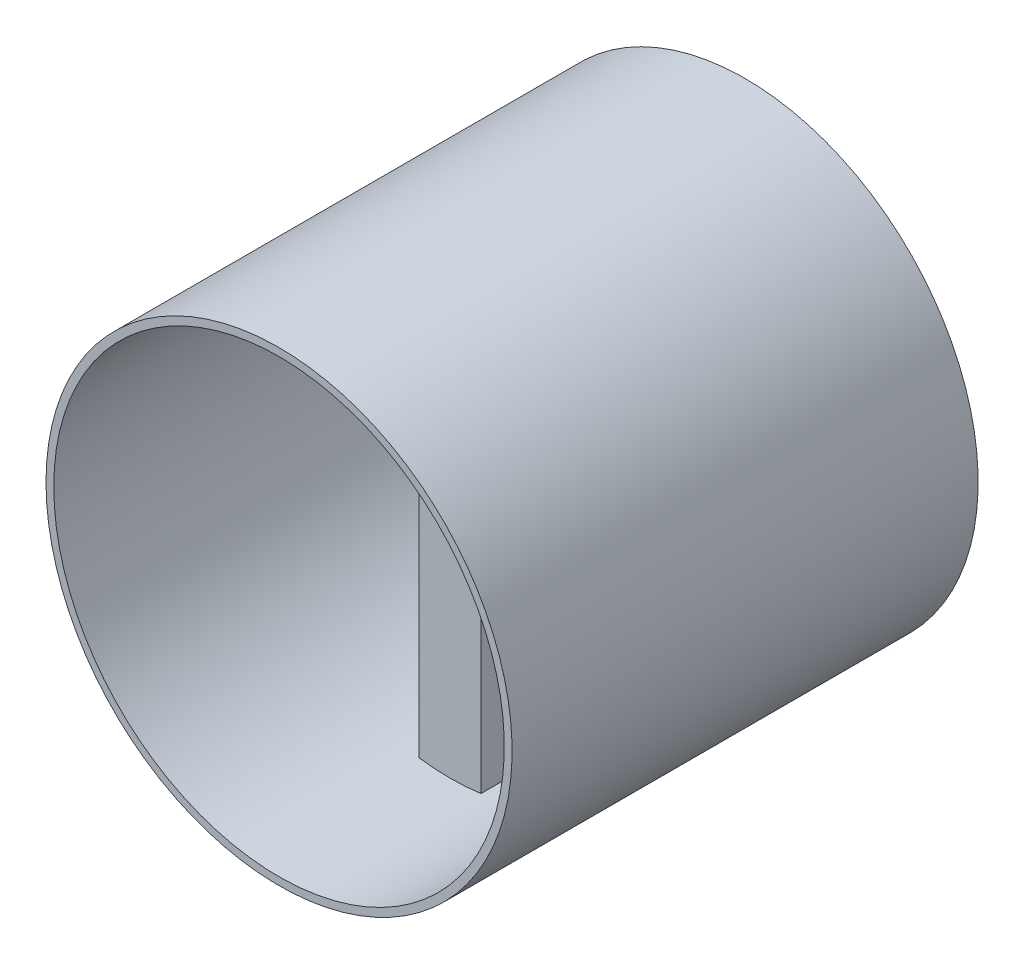
ISO-10303-21;
HEADER;
FILE_DESCRIPTION(('STEP AP214'),'2;1');
FILE_NAME('part.step','',(''),(''),'','','');
FILE_SCHEMA(('AUTOMOTIVE_DESIGN { 1 0 10303 214 1 1 1 1 }'));
ENDSEC;
DATA;
#1=APPLICATION_CONTEXT('core data for automotive mechanical design processes');
#2=APPLICATION_PROTOCOL_DEFINITION('international standard','automotive_design',2000,#1);
#3=PRODUCT_CONTEXT('',#1,'mechanical');
#4=PRODUCT('Part','Part','',(#3));
#5=PRODUCT_RELATED_PRODUCT_CATEGORY('part','',(#4));
#6=PRODUCT_DEFINITION_FORMATION('','',#4);
#7=PRODUCT_DEFINITION_CONTEXT('part definition',#1,'design');
#8=PRODUCT_DEFINITION('design','',#6,#7);
#9=PRODUCT_DEFINITION_SHAPE('','',#8);
#10=(LENGTH_UNIT() NAMED_UNIT(*) SI_UNIT(.MILLI.,.METRE.));
#11=(NAMED_UNIT(*) PLANE_ANGLE_UNIT() SI_UNIT($,.RADIAN.));
#12=(NAMED_UNIT(*) SI_UNIT($,.STERADIAN.) SOLID_ANGLE_UNIT());
#13=UNCERTAINTY_MEASURE_WITH_UNIT(LENGTH_MEASURE(1.E-05),#10,'distance_accuracy_value','');
#14=(GEOMETRIC_REPRESENTATION_CONTEXT(3) GLOBAL_UNCERTAINTY_ASSIGNED_CONTEXT((#13)) GLOBAL_UNIT_ASSIGNED_CONTEXT((#10,
#11,#12)) REPRESENTATION_CONTEXT('',''));
#15=CARTESIAN_POINT('',(0.,0.,0.));
#16=DIRECTION('',(0.,0.,1.));
#17=DIRECTION('',(1.,0.,0.));
#18=AXIS2_PLACEMENT_3D('',#15,#16,#17);
#19=CARTESIAN_POINT('',(0.,0.,60.));
#20=DIRECTION('',(1.,0.,0.));
#21=DIRECTION('',(0.,0.,-1.));
#22=AXIS2_PLACEMENT_3D('',#19,#20,#21);
#23=PLANE('',#22);
#24=DIRECTION('',(0.,-1.,0.));
#25=VECTOR('',#24,1.);
#26=CARTESIAN_POINT('',(0.,0.,38.));
#27=LINE('',#26,#25);
#28=CARTESIAN_POINT('',(0.,58.2228132326902,38.));
#29=VERTEX_POINT('',#28);
#30=CARTESIAN_POINT('',(0.,0.77718676730985,38.));
#31=VERTEX_POINT('',#30);
#32=EDGE_CURVE('E139',#29,#31,#27,.T.);
#33=ORIENTED_EDGE('',*,*,#32,.F.);
#34=DIRECTION('',(0.,0.,-1.));
#35=VECTOR('',#34,1.);
#36=CARTESIAN_POINT('',(0.,58.2228132326901,60.));
#37=LINE('',#36,#35);
#38=CARTESIAN_POINT('',(0.,58.2228132326901,30.));
#39=VERTEX_POINT('',#38);
#40=EDGE_CURVE('E48',#39,#29,#37,.F.);
#41=ORIENTED_EDGE('',*,*,#40,.F.);
#42=DIRECTION('',(0.,1.,0.));
#43=VECTOR('',#42,1.);
#44=CARTESIAN_POINT('',(0.,0.,30.));
#45=LINE('',#44,#43);
#46=CARTESIAN_POINT('',(0.,0.77718676730985,30.));
#47=VERTEX_POINT('',#46);
#48=EDGE_CURVE('E175',#47,#39,#45,.T.);
#49=ORIENTED_EDGE('',*,*,#48,.F.);
#50=DIRECTION('',(0.,0.,-1.));
#51=VECTOR('',#50,1.);
#52=CARTESIAN_POINT('',(0.,0.77718676730985,60.));
#53=LINE('',#52,#51);
#54=EDGE_CURVE('E11',#31,#47,#53,.T.);
#55=ORIENTED_EDGE('',*,*,#54,.F.);
#56=EDGE_LOOP('',(#33,#41,#49,#55));
#57=FACE_BOUND('',#56,.T.);
#58=ADVANCED_FACE('F39',(#57),#23,.F.);
#59=CARTESIAN_POINT('',(8.,0.,60.));
#60=DIRECTION('',(-1.,0.,0.));
#61=DIRECTION('',(0.,-1.,0.));
#62=AXIS2_PLACEMENT_3D('',#59,#60,#61);
#63=PLANE('',#62);
#64=DIRECTION('',(0.,1.,0.));
#65=VECTOR('',#64,1.);
#66=CARTESIAN_POINT('',(8.,0.,38.));
#67=LINE('',#66,#65);
#68=CARTESIAN_POINT('',(8.,0.77718676730985,38.));
#69=VERTEX_POINT('',#68);
#70=CARTESIAN_POINT('',(7.99999999999999,58.2228132326902,38.));
#71=VERTEX_POINT('',#70);
#72=EDGE_CURVE('E128',#69,#71,#67,.T.);
#73=ORIENTED_EDGE('',*,*,#72,.F.);
#74=DIRECTION('',(0.,0.,-1.));
#75=VECTOR('',#74,1.);
#76=CARTESIAN_POINT('',(8.,0.77718676730985,60.));
#77=LINE('',#76,#75);
#78=CARTESIAN_POINT('',(8.,0.77718676730985,30.));
#79=VERTEX_POINT('',#78);
#80=EDGE_CURVE('E155',#79,#69,#77,.F.);
#81=ORIENTED_EDGE('',*,*,#80,.F.);
#82=DIRECTION('',(0.,-1.,0.));
#83=VECTOR('',#82,1.);
#84=CARTESIAN_POINT('',(8.,0.,30.));
#85=LINE('',#84,#83);
#86=CARTESIAN_POINT('',(7.99999999999999,58.2228132326901,30.));
#87=VERTEX_POINT('',#86);
#88=EDGE_CURVE('E153',#87,#79,#85,.T.);
#89=ORIENTED_EDGE('',*,*,#88,.F.);
#90=DIRECTION('',(0.,0.,-1.));
#91=VECTOR('',#90,1.);
#92=CARTESIAN_POINT('',(7.99999999999999,58.2228132326901,60.));
#93=LINE('',#92,#91);
#94=EDGE_CURVE('E146',#71,#87,#93,.T.);
#95=ORIENTED_EDGE('',*,*,#94,.F.);
#96=EDGE_LOOP('',(#73,#81,#89,#95));
#97=FACE_BOUND('',#96,.T.);
#98=ADVANCED_FACE('F152',(#97),#63,.F.);
#99=CARTESIAN_POINT('',(0.,0.,60.));
#100=DIRECTION('',(0.,0.,-1.));
#101=DIRECTION('',(-1.,0.,0.));
#102=AXIS2_PLACEMENT_3D('',#99,#100,#101);
#103=PLANE('',#102);
#104=CARTESIAN_POINT('',(4.,29.5,60.));
#105=DIRECTION('',(0.,0.,-1.));
#106=DIRECTION('',(-1.,0.,0.));
#107=AXIS2_PLACEMENT_3D('',#104,#105,#106);
#108=CIRCLE('',#107,29.);
#109=CARTESIAN_POINT('',(-25.,29.5,60.));
#110=VERTEX_POINT('',#109);
#111=EDGE_CURVE('E167',#110,#110,#108,.T.);
#112=ORIENTED_EDGE('',*,*,#111,.T.);
#113=EDGE_LOOP('',(#112));
#114=FACE_BOUND('',#113,.T.);
#115=CARTESIAN_POINT('',(4.,29.5,60.));
#116=DIRECTION('',(0.,0.,-1.));
#117=DIRECTION('',(-1.,0.,0.));
#118=AXIS2_PLACEMENT_3D('',#115,#116,#117);
#119=CIRCLE('',#118,30.);
#120=CARTESIAN_POINT('',(-26.,29.5,60.));
#121=VERTEX_POINT('',#120);
#122=EDGE_CURVE('E160',#121,#121,#119,.T.);
#123=ORIENTED_EDGE('',*,*,#122,.F.);
#124=EDGE_LOOP('',(#123));
#125=FACE_BOUND('',#124,.T.);
#126=ADVANCED_FACE('F344',(#114,#125),#103,.F.);
#127=CARTESIAN_POINT('',(0.,0.,0.));
#128=DIRECTION('',(0.,0.,-1.));
#129=DIRECTION('',(-1.,0.,0.));
#130=AXIS2_PLACEMENT_3D('',#127,#128,#129);
#131=PLANE('',#130);
#132=CARTESIAN_POINT('',(4.,29.5,0.));
#133=DIRECTION('',(0.,0.,-1.));
#134=DIRECTION('',(-1.,0.,0.));
#135=AXIS2_PLACEMENT_3D('',#132,#133,#134);
#136=CIRCLE('',#135,29.);
#137=CARTESIAN_POINT('',(-25.,29.5,0.));
#138=VERTEX_POINT('',#137);
#139=EDGE_CURVE('E171',#138,#138,#136,.T.);
#140=ORIENTED_EDGE('',*,*,#139,.F.);
#141=EDGE_LOOP('',(#140));
#142=FACE_BOUND('',#141,.T.);
#143=CARTESIAN_POINT('',(4.,29.5,0.));
#144=DIRECTION('',(0.,0.,-1.));
#145=DIRECTION('',(-1.,0.,0.));
#146=AXIS2_PLACEMENT_3D('',#143,#144,#145);
#147=CIRCLE('',#146,30.);
#148=CARTESIAN_POINT('',(-26.,29.5,0.));
#149=VERTEX_POINT('',#148);
#150=EDGE_CURVE('E163',#149,#149,#147,.T.);
#151=ORIENTED_EDGE('',*,*,#150,.T.);
#152=EDGE_LOOP('',(#151));
#153=FACE_BOUND('',#152,.T.);
#154=ADVANCED_FACE('F361',(#142,#153),#131,.T.);
#155=CARTESIAN_POINT('',(4.,29.5,60.));
#156=DIRECTION('',(0.,0.,-1.));
#157=DIRECTION('',(-1.,0.,0.));
#158=AXIS2_PLACEMENT_3D('',#155,#156,#157);
#159=CYLINDRICAL_SURFACE('',#158,29.);
#160=ORIENTED_EDGE('',*,*,#111,.F.);
#161=EDGE_LOOP('',(#160));
#162=FACE_BOUND('',#161,.T.);
#163=CARTESIAN_POINT('',(4.,29.5,38.));
#164=DIRECTION('',(0.,0.,1.));
#165=DIRECTION('',(1.,0.,0.));
#166=AXIS2_PLACEMENT_3D('',#163,#164,#165);
#167=CIRCLE('',#166,29.);
#168=EDGE_CURVE('E133',#31,#69,#167,.T.);
#169=ORIENTED_EDGE('',*,*,#168,.F.);
#170=ORIENTED_EDGE('',*,*,#54,.T.);
#171=CARTESIAN_POINT('',(4.,29.5,30.));
#172=DIRECTION('',(0.,0.,-1.));
#173=DIRECTION('',(-1.,0.,0.));
#174=AXIS2_PLACEMENT_3D('',#171,#172,#173);
#175=CIRCLE('',#174,29.);
#176=EDGE_CURVE('E186',#79,#47,#175,.T.);
#177=ORIENTED_EDGE('',*,*,#176,.F.);
#178=ORIENTED_EDGE('',*,*,#80,.T.);
#179=EDGE_LOOP('',(#169,#170,#177,#178));
#180=FACE_BOUND('',#179,.T.);
#181=ORIENTED_EDGE('',*,*,#40,.T.);
#182=EDGE_CURVE('E131',#71,#29,#167,.T.);
#183=ORIENTED_EDGE('',*,*,#182,.F.);
#184=ORIENTED_EDGE('',*,*,#94,.T.);
#185=EDGE_CURVE('E183',#39,#87,#175,.T.);
#186=ORIENTED_EDGE('',*,*,#185,.F.);
#187=EDGE_LOOP('',(#181,#183,#184,#186));
#188=FACE_BOUND('',#187,.T.);
#189=ORIENTED_EDGE('',*,*,#139,.T.);
#190=EDGE_LOOP('',(#189));
#191=FACE_BOUND('',#190,.T.);
#192=ADVANCED_FACE('F143',(#162,#180,#188,#191),#159,.F.);
#193=CARTESIAN_POINT('',(4.,29.5,60.));
#194=DIRECTION('',(0.,0.,-1.));
#195=DIRECTION('',(-1.,0.,0.));
#196=AXIS2_PLACEMENT_3D('',#193,#194,#195);
#197=CYLINDRICAL_SURFACE('',#196,30.);
#198=ORIENTED_EDGE('',*,*,#122,.T.);
#199=EDGE_LOOP('',(#198));
#200=FACE_BOUND('',#199,.T.);
#201=ORIENTED_EDGE('',*,*,#150,.F.);
#202=EDGE_LOOP('',(#201));
#203=FACE_BOUND('',#202,.T.);
#204=ADVANCED_FACE('F349',(#200,#203),#197,.T.);
#205=CARTESIAN_POINT('',(4.,29.5,30.));
#206=DIRECTION('',(0.,0.,-1.));
#207=DIRECTION('',(-1.,0.,0.));
#208=AXIS2_PLACEMENT_3D('',#205,#206,#207);
#209=PLANE('',#208);
#210=CARTESIAN_POINT('',(4.,29.5,30.));
#211=DIRECTION('',(0.,0.,-1.));
#212=DIRECTION('',(-1.,0.,0.));
#213=AXIS2_PLACEMENT_3D('',#210,#211,#212);
#214=CIRCLE('',#213,3.);
#215=CARTESIAN_POINT('',(6.96725784447476,29.9420190995907,30.));
#216=VERTEX_POINT('',#215);
#217=CARTESIAN_POINT('',(6.96725784447476,29.0579809004093,30.));
#218=VERTEX_POINT('',#217);
#219=EDGE_CURVE('E55',#216,#218,#214,.T.);
#220=ORIENTED_EDGE('',*,*,#219,.F.);
#221=DIRECTION('',(0.0738716855153117,-0.997267754456709,0.));
#222=VECTOR('',#221,1.);
#223=CARTESIAN_POINT('',(6.,43.,30.));
#224=LINE('',#223,#222);
#225=CARTESIAN_POINT('',(6.,43.,30.));
#226=VERTEX_POINT('',#225);
#227=EDGE_CURVE('E212',#226,#216,#224,.T.);
#228=ORIENTED_EDGE('',*,*,#227,.F.);
#229=CARTESIAN_POINT('',(4.,43.,30.));
#230=DIRECTION('',(0.,0.,-1.));
#231=DIRECTION('',(-1.,0.,0.));
#232=AXIS2_PLACEMENT_3D('',#229,#230,#231);
#233=CIRCLE('',#232,2.);
#234=CARTESIAN_POINT('',(2.,43.,30.));
#235=VERTEX_POINT('',#234);
#236=EDGE_CURVE('E217',#235,#226,#233,.T.);
#237=ORIENTED_EDGE('',*,*,#236,.F.);
#238=DIRECTION('',(0.0738716855153117,0.997267754456709,0.));
#239=VECTOR('',#238,1.);
#240=CARTESIAN_POINT('',(1.03274215552524,29.9420190995907,30.));
#241=LINE('',#240,#239);
#242=CARTESIAN_POINT('',(1.03274215552524,29.9420190995907,30.));
#243=VERTEX_POINT('',#242);
#244=EDGE_CURVE('E221',#243,#235,#241,.T.);
#245=ORIENTED_EDGE('',*,*,#244,.F.);
#246=CARTESIAN_POINT('',(4.,29.5,30.));
#247=DIRECTION('',(0.,0.,-1.));
#248=DIRECTION('',(1.,0.,0.));
#249=AXIS2_PLACEMENT_3D('',#246,#247,#248);
#250=CIRCLE('',#249,3.);
#251=CARTESIAN_POINT('',(1.03274215552524,29.0579809004093,30.));
#252=VERTEX_POINT('',#251);
#253=EDGE_CURVE('E225',#252,#243,#250,.T.);
#254=ORIENTED_EDGE('',*,*,#253,.F.);
#255=DIRECTION('',(-0.0738716855153117,0.997267754456709,0.));
#256=VECTOR('',#255,1.);
#257=CARTESIAN_POINT('',(2.,16.,30.));
#258=LINE('',#257,#256);
#259=CARTESIAN_POINT('',(2.,16.,30.));
#260=VERTEX_POINT('',#259);
#261=EDGE_CURVE('E229',#260,#252,#258,.T.);
#262=ORIENTED_EDGE('',*,*,#261,.F.);
#263=CARTESIAN_POINT('',(4.,16.,30.));
#264=DIRECTION('',(0.,0.,-1.));
#265=DIRECTION('',(1.,0.,0.));
#266=AXIS2_PLACEMENT_3D('',#263,#264,#265);
#267=CIRCLE('',#266,2.);
#268=CARTESIAN_POINT('',(6.,16.,30.));
#269=VERTEX_POINT('',#268);
#270=EDGE_CURVE('E233',#269,#260,#267,.T.);
#271=ORIENTED_EDGE('',*,*,#270,.F.);
#272=DIRECTION('',(-0.0738716855153117,-0.997267754456709,0.));
#273=VECTOR('',#272,1.);
#274=CARTESIAN_POINT('',(6.,16.,30.));
#275=LINE('',#274,#273);
#276=EDGE_CURVE('E237',#218,#269,#275,.T.);
#277=ORIENTED_EDGE('',*,*,#276,.F.);
#278=EDGE_LOOP('',(#220,#228,#237,#245,#254,#262,#271,#277));
#279=FACE_BOUND('',#278,.T.);
#280=ORIENTED_EDGE('',*,*,#48,.T.);
#281=ORIENTED_EDGE('',*,*,#185,.T.);
#282=ORIENTED_EDGE('',*,*,#88,.T.);
#283=ORIENTED_EDGE('',*,*,#176,.T.);
#284=EDGE_LOOP('',(#280,#281,#282,#283));
#285=FACE_BOUND('',#284,.T.);
#286=ADVANCED_FACE('F328',(#279,#285),#209,.T.);
#287=CARTESIAN_POINT('',(4.,29.5,31.5));
#288=DIRECTION('',(0.,0.,-1.));
#289=DIRECTION('',(-1.,0.,0.));
#290=AXIS2_PLACEMENT_3D('',#287,#288,#289);
#291=CYLINDRICAL_SURFACE('',#290,3.);
#292=ORIENTED_EDGE('',*,*,#219,.T.);
#293=DIRECTION('',(0.,0.,-1.));
#294=VECTOR('',#293,1.);
#295=CARTESIAN_POINT('',(6.96725784447476,29.0579809004093,31.5));
#296=LINE('',#295,#294);
#297=CARTESIAN_POINT('',(6.96725784447476,29.0579809004093,31.5));
#298=VERTEX_POINT('',#297);
#299=EDGE_CURVE('E187',#298,#218,#296,.T.);
#300=ORIENTED_EDGE('',*,*,#299,.F.);
#301=CARTESIAN_POINT('',(4.,29.5,31.5));
#302=DIRECTION('',(0.,0.,-1.));
#303=DIRECTION('',(-1.,0.,0.));
#304=AXIS2_PLACEMENT_3D('',#301,#302,#303);
#305=CIRCLE('',#304,3.);
#306=CARTESIAN_POINT('',(6.96725784447476,29.9420190995907,31.5));
#307=VERTEX_POINT('',#306);
#308=EDGE_CURVE('E216',#307,#298,#305,.T.);
#309=ORIENTED_EDGE('',*,*,#308,.F.);
#310=DIRECTION('',(0.,0.,-1.));
#311=VECTOR('',#310,1.);
#312=CARTESIAN_POINT('',(6.96725784447476,29.9420190995907,31.5));
#313=LINE('',#312,#311);
#314=EDGE_CURVE('E209',#307,#216,#313,.T.);
#315=ORIENTED_EDGE('',*,*,#314,.T.);
#316=EDGE_LOOP('',(#292,#300,#309,#315));
#317=FACE_BOUND('',#316,.T.);
#318=ADVANCED_FACE('F302',(#317),#291,.F.);
#319=CARTESIAN_POINT('',(6.,43.,31.5));
#320=DIRECTION('',(0.997267754456709,0.0738716855153117,0.));
#321=DIRECTION('',(-0.0738716855153117,0.997267754456709,0.));
#322=AXIS2_PLACEMENT_3D('',#319,#320,#321);
#323=PLANE('',#322);
#324=ORIENTED_EDGE('',*,*,#227,.T.);
#325=ORIENTED_EDGE('',*,*,#314,.F.);
#326=DIRECTION('',(0.0738716855153117,-0.997267754456709,0.));
#327=VECTOR('',#326,1.);
#328=CARTESIAN_POINT('',(6.,43.,31.5));
#329=LINE('',#328,#327);
#330=CARTESIAN_POINT('',(6.,43.,31.5));
#331=VERTEX_POINT('',#330);
#332=EDGE_CURVE('E191',#331,#307,#329,.T.);
#333=ORIENTED_EDGE('',*,*,#332,.F.);
#334=DIRECTION('',(0.,0.,-1.));
#335=VECTOR('',#334,1.);
#336=CARTESIAN_POINT('',(6.,43.,31.5));
#337=LINE('',#336,#335);
#338=EDGE_CURVE('E206',#331,#226,#337,.T.);
#339=ORIENTED_EDGE('',*,*,#338,.T.);
#340=EDGE_LOOP('',(#324,#325,#333,#339));
#341=FACE_BOUND('',#340,.T.);
#342=ADVANCED_FACE('F324',(#341),#323,.F.);
#343=CARTESIAN_POINT('',(4.,43.,31.5));
#344=DIRECTION('',(0.,0.,-1.));
#345=DIRECTION('',(-1.,0.,0.));
#346=AXIS2_PLACEMENT_3D('',#343,#344,#345);
#347=CYLINDRICAL_SURFACE('',#346,2.);
#348=ORIENTED_EDGE('',*,*,#236,.T.);
#349=ORIENTED_EDGE('',*,*,#338,.F.);
#350=CARTESIAN_POINT('',(4.,43.,31.5));
#351=DIRECTION('',(0.,0.,-1.));
#352=DIRECTION('',(-1.,0.,0.));
#353=AXIS2_PLACEMENT_3D('',#350,#351,#352);
#354=CIRCLE('',#353,2.);
#355=CARTESIAN_POINT('',(2.,43.,31.5));
#356=VERTEX_POINT('',#355);
#357=EDGE_CURVE('E246',#356,#331,#354,.T.);
#358=ORIENTED_EDGE('',*,*,#357,.F.);
#359=DIRECTION('',(0.,0.,-1.));
#360=VECTOR('',#359,1.);
#361=CARTESIAN_POINT('',(2.,43.,31.5));
#362=LINE('',#361,#360);
#363=EDGE_CURVE('E203',#356,#235,#362,.T.);
#364=ORIENTED_EDGE('',*,*,#363,.T.);
#365=EDGE_LOOP('',(#348,#349,#358,#364));
#366=FACE_BOUND('',#365,.T.);
#367=ADVANCED_FACE('F330',(#366),#347,.F.);
#368=CARTESIAN_POINT('',(1.03274215552524,29.9420190995907,31.5));
#369=DIRECTION('',(-0.997267754456709,0.0738716855153117,0.));
#370=DIRECTION('',(-0.0738716855153117,-0.997267754456709,0.));
#371=AXIS2_PLACEMENT_3D('',#368,#369,#370);
#372=PLANE('',#371);
#373=ORIENTED_EDGE('',*,*,#244,.T.);
#374=ORIENTED_EDGE('',*,*,#363,.F.);
#375=DIRECTION('',(0.0738716855153117,0.997267754456709,0.));
#376=VECTOR('',#375,1.);
#377=CARTESIAN_POINT('',(1.03274215552524,29.9420190995907,31.5));
#378=LINE('',#377,#376);
#379=CARTESIAN_POINT('',(1.03274215552524,29.9420190995907,31.5));
#380=VERTEX_POINT('',#379);
#381=EDGE_CURVE('E250',#380,#356,#378,.T.);
#382=ORIENTED_EDGE('',*,*,#381,.F.);
#383=DIRECTION('',(0.,0.,-1.));
#384=VECTOR('',#383,1.);
#385=CARTESIAN_POINT('',(1.03274215552524,29.9420190995907,31.5));
#386=LINE('',#385,#384);
#387=EDGE_CURVE('E200',#380,#243,#386,.T.);
#388=ORIENTED_EDGE('',*,*,#387,.T.);
#389=EDGE_LOOP('',(#373,#374,#382,#388));
#390=FACE_BOUND('',#389,.T.);
#391=ADVANCED_FACE('F320',(#390),#372,.F.);
#392=CARTESIAN_POINT('',(4.,29.5,31.5));
#393=DIRECTION('',(0.,0.,-1.));
#394=DIRECTION('',(-1.,0.,0.));
#395=AXIS2_PLACEMENT_3D('',#392,#393,#394);
#396=CYLINDRICAL_SURFACE('',#395,3.);
#397=ORIENTED_EDGE('',*,*,#253,.T.);
#398=ORIENTED_EDGE('',*,*,#387,.F.);
#399=CARTESIAN_POINT('',(4.,29.5,31.5));
#400=DIRECTION('',(0.,0.,-1.));
#401=DIRECTION('',(1.,0.,0.));
#402=AXIS2_PLACEMENT_3D('',#399,#400,#401);
#403=CIRCLE('',#402,3.);
#404=CARTESIAN_POINT('',(1.03274215552524,29.0579809004093,31.5));
#405=VERTEX_POINT('',#404);
#406=EDGE_CURVE('E254',#405,#380,#403,.T.);
#407=ORIENTED_EDGE('',*,*,#406,.F.);
#408=DIRECTION('',(0.,0.,-1.));
#409=VECTOR('',#408,1.);
#410=CARTESIAN_POINT('',(1.03274215552524,29.0579809004093,31.5));
#411=LINE('',#410,#409);
#412=EDGE_CURVE('E197',#405,#252,#411,.T.);
#413=ORIENTED_EDGE('',*,*,#412,.T.);
#414=EDGE_LOOP('',(#397,#398,#407,#413));
#415=FACE_BOUND('',#414,.T.);
#416=ADVANCED_FACE('F316',(#415),#396,.F.);
#417=CARTESIAN_POINT('',(2.,16.,31.5));
#418=DIRECTION('',(-0.997267754456709,-0.0738716855153117,0.));
#419=DIRECTION('',(0.0738716855153117,-0.997267754456709,0.));
#420=AXIS2_PLACEMENT_3D('',#417,#418,#419);
#421=PLANE('',#420);
#422=ORIENTED_EDGE('',*,*,#261,.T.);
#423=ORIENTED_EDGE('',*,*,#412,.F.);
#424=DIRECTION('',(-0.0738716855153117,0.997267754456709,0.));
#425=VECTOR('',#424,1.);
#426=CARTESIAN_POINT('',(2.,16.,31.5));
#427=LINE('',#426,#425);
#428=CARTESIAN_POINT('',(2.,16.,31.5));
#429=VERTEX_POINT('',#428);
#430=EDGE_CURVE('E258',#429,#405,#427,.T.);
#431=ORIENTED_EDGE('',*,*,#430,.F.);
#432=DIRECTION('',(0.,0.,-1.));
#433=VECTOR('',#432,1.);
#434=CARTESIAN_POINT('',(2.,16.,31.5));
#435=LINE('',#434,#433);
#436=EDGE_CURVE('E194',#429,#260,#435,.T.);
#437=ORIENTED_EDGE('',*,*,#436,.T.);
#438=EDGE_LOOP('',(#422,#423,#431,#437));
#439=FACE_BOUND('',#438,.T.);
#440=ADVANCED_FACE('F312',(#439),#421,.F.);
#441=CARTESIAN_POINT('',(4.,16.,31.5));
#442=DIRECTION('',(0.,0.,-1.));
#443=DIRECTION('',(-1.,0.,0.));
#444=AXIS2_PLACEMENT_3D('',#441,#442,#443);
#445=CYLINDRICAL_SURFACE('',#444,2.);
#446=ORIENTED_EDGE('',*,*,#270,.T.);
#447=ORIENTED_EDGE('',*,*,#436,.F.);
#448=CARTESIAN_POINT('',(4.,16.,31.5));
#449=DIRECTION('',(0.,0.,-1.));
#450=DIRECTION('',(1.,0.,0.));
#451=AXIS2_PLACEMENT_3D('',#448,#449,#450);
#452=CIRCLE('',#451,2.);
#453=CARTESIAN_POINT('',(6.,16.,31.5));
#454=VERTEX_POINT('',#453);
#455=EDGE_CURVE('E262',#454,#429,#452,.T.);
#456=ORIENTED_EDGE('',*,*,#455,.F.);
#457=DIRECTION('',(0.,0.,-1.));
#458=VECTOR('',#457,1.);
#459=CARTESIAN_POINT('',(6.,16.,31.5));
#460=LINE('',#459,#458);
#461=EDGE_CURVE('E190',#454,#269,#460,.T.);
#462=ORIENTED_EDGE('',*,*,#461,.T.);
#463=EDGE_LOOP('',(#446,#447,#456,#462));
#464=FACE_BOUND('',#463,.T.);
#465=ADVANCED_FACE('F308',(#464),#445,.F.);
#466=CARTESIAN_POINT('',(6.,16.,31.5));
#467=DIRECTION('',(0.997267754456709,-0.0738716855153117,0.));
#468=DIRECTION('',(0.0738716855153117,0.997267754456709,0.));
#469=AXIS2_PLACEMENT_3D('',#466,#467,#468);
#470=PLANE('',#469);
#471=ORIENTED_EDGE('',*,*,#276,.T.);
#472=ORIENTED_EDGE('',*,*,#461,.F.);
#473=DIRECTION('',(-0.0738716855153117,-0.997267754456709,0.));
#474=VECTOR('',#473,1.);
#475=CARTESIAN_POINT('',(6.,16.,31.5));
#476=LINE('',#475,#474);
#477=EDGE_CURVE('E266',#298,#454,#476,.T.);
#478=ORIENTED_EDGE('',*,*,#477,.F.);
#479=ORIENTED_EDGE('',*,*,#299,.T.);
#480=EDGE_LOOP('',(#471,#472,#478,#479));
#481=FACE_BOUND('',#480,.T.);
#482=ADVANCED_FACE('F297',(#481),#470,.F.);
#483=CARTESIAN_POINT('',(4.,29.5,31.5));
#484=DIRECTION('',(0.,0.,-1.));
#485=DIRECTION('',(-1.,0.,0.));
#486=AXIS2_PLACEMENT_3D('',#483,#484,#485);
#487=PLANE('',#486);
#488=CARTESIAN_POINT('',(4.,29.5,31.5));
#489=DIRECTION('',(0.,0.,-1.));
#490=DIRECTION('',(-1.,0.,0.));
#491=AXIS2_PLACEMENT_3D('',#488,#489,#490);
#492=CIRCLE('',#491,0.750000000000001);
#493=CARTESIAN_POINT('',(3.25,29.5,31.5));
#494=VERTEX_POINT('',#493);
#495=EDGE_CURVE('E42',#494,#494,#492,.T.);
#496=ORIENTED_EDGE('',*,*,#495,.F.);
#497=EDGE_LOOP('',(#496));
#498=FACE_BOUND('',#497,.T.);
#499=ORIENTED_EDGE('',*,*,#308,.T.);
#500=ORIENTED_EDGE('',*,*,#477,.T.);
#501=ORIENTED_EDGE('',*,*,#455,.T.);
#502=ORIENTED_EDGE('',*,*,#430,.T.);
#503=ORIENTED_EDGE('',*,*,#406,.T.);
#504=ORIENTED_EDGE('',*,*,#381,.T.);
#505=ORIENTED_EDGE('',*,*,#357,.T.);
#506=ORIENTED_EDGE('',*,*,#332,.T.);
#507=EDGE_LOOP('',(#499,#500,#501,#502,#503,#504,#505,#506));
#508=FACE_BOUND('',#507,.T.);
#509=ADVANCED_FACE('F294',(#498,#508),#487,.T.);
#510=CARTESIAN_POINT('',(4.,29.5,38.));
#511=DIRECTION('',(0.,0.,1.));
#512=DIRECTION('',(1.,0.,0.));
#513=AXIS2_PLACEMENT_3D('',#510,#511,#512);
#514=PLANE('',#513);
#515=CARTESIAN_POINT('',(4.,29.5,38.));
#516=DIRECTION('',(0.,0.,1.));
#517=DIRECTION('',(1.,0.,0.));
#518=AXIS2_PLACEMENT_3D('',#515,#516,#517);
#519=CIRCLE('',#518,2.);
#520=CARTESIAN_POINT('',(6.,29.5,38.));
#521=VERTEX_POINT('',#520);
#522=EDGE_CURVE('E275',#521,#521,#519,.T.);
#523=ORIENTED_EDGE('',*,*,#522,.F.);
#524=EDGE_LOOP('',(#523));
#525=FACE_BOUND('',#524,.T.);
#526=ORIENTED_EDGE('',*,*,#32,.T.);
#527=ORIENTED_EDGE('',*,*,#168,.T.);
#528=ORIENTED_EDGE('',*,*,#72,.T.);
#529=ORIENTED_EDGE('',*,*,#182,.T.);
#530=EDGE_LOOP('',(#526,#527,#528,#529));
#531=FACE_BOUND('',#530,.T.);
#532=ADVANCED_FACE('F130',(#525,#531),#514,.T.);
#533=CARTESIAN_POINT('',(4.,29.5,34.3));
#534=DIRECTION('',(0.,0.,1.));
#535=DIRECTION('',(1.,0.,0.));
#536=AXIS2_PLACEMENT_3D('',#533,#534,#535);
#537=CYLINDRICAL_SURFACE('',#536,2.);
#538=CARTESIAN_POINT('',(4.,29.5,34.3));
#539=DIRECTION('',(0.,0.,1.));
#540=DIRECTION('',(1.,0.,0.));
#541=AXIS2_PLACEMENT_3D('',#538,#539,#540);
#542=CIRCLE('',#541,2.);
#543=CARTESIAN_POINT('',(6.,29.5,34.3));
#544=VERTEX_POINT('',#543);
#545=EDGE_CURVE('E279',#544,#544,#542,.T.);
#546=ORIENTED_EDGE('',*,*,#545,.F.);
#547=EDGE_LOOP('',(#546));
#548=FACE_BOUND('',#547,.T.);
#549=ORIENTED_EDGE('',*,*,#522,.T.);
#550=EDGE_LOOP('',(#549));
#551=FACE_BOUND('',#550,.T.);
#552=ADVANCED_FACE('F488',(#548,#551),#537,.F.);
#553=CARTESIAN_POINT('',(4.,29.5,34.3));
#554=DIRECTION('',(0.,0.,1.));
#555=DIRECTION('',(1.,0.,0.));
#556=AXIS2_PLACEMENT_3D('',#553,#554,#555);
#557=PLANE('',#556);
#558=CARTESIAN_POINT('',(4.,29.5,34.3));
#559=DIRECTION('',(0.,0.,1.));
#560=DIRECTION('',(1.,0.,0.));
#561=AXIS2_PLACEMENT_3D('',#558,#559,#560);
#562=CIRCLE('',#561,0.750000000000001);
#563=CARTESIAN_POINT('',(4.75,29.5,34.3));
#564=VERTEX_POINT('',#563);
#565=EDGE_CURVE('E283',#564,#564,#562,.T.);
#566=ORIENTED_EDGE('',*,*,#565,.F.);
#567=EDGE_LOOP('',(#566));
#568=FACE_BOUND('',#567,.T.);
#569=ORIENTED_EDGE('',*,*,#545,.T.);
#570=EDGE_LOOP('',(#569));
#571=FACE_BOUND('',#570,.T.);
#572=ADVANCED_FACE('F496',(#568,#571),#557,.T.);
#573=CARTESIAN_POINT('',(4.,29.5,30.6));
#574=DIRECTION('',(0.,0.,1.));
#575=DIRECTION('',(1.,0.,0.));
#576=AXIS2_PLACEMENT_3D('',#573,#574,#575);
#577=CYLINDRICAL_SURFACE('',#576,0.750000000000001);
#578=ORIENTED_EDGE('',*,*,#495,.T.);
#579=EDGE_LOOP('',(#578));
#580=FACE_BOUND('',#579,.T.);
#581=ORIENTED_EDGE('',*,*,#565,.T.);
#582=EDGE_LOOP('',(#581));
#583=FACE_BOUND('',#582,.T.);
#584=ADVANCED_FACE('F292',(#580,#583),#577,.F.);
#585=CLOSED_SHELL('',(#58,#98,#126,#154,#192,#204,#286,#318,#342,#367,#391,#416,#440,#465,#482,
#509,#532,#552,#572,#584));
#586=MANIFOLD_SOLID_BREP('B2',#585);
#587=ADVANCED_BREP_SHAPE_REPRESENTATION('',(#18,#586),#14);
#588=SHAPE_DEFINITION_REPRESENTATION(#9,#587);
ENDSEC;
END-ISO-10303-21;
